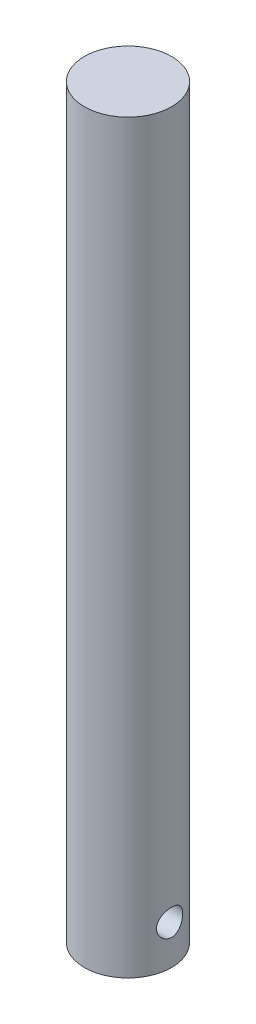
ISO-10303-21;
HEADER;
FILE_DESCRIPTION(('STEP AP214'),'2;1');
FILE_NAME('part.step','',(''),(''),'','','');
FILE_SCHEMA(('AUTOMOTIVE_DESIGN { 1 0 10303 214 1 1 1 1 }'));
ENDSEC;
DATA;
#1=APPLICATION_CONTEXT('core data for automotive mechanical design processes');
#2=APPLICATION_PROTOCOL_DEFINITION('international standard','automotive_design',2000,#1);
#3=PRODUCT_CONTEXT('',#1,'mechanical');
#4=PRODUCT('Part','Part','',(#3));
#5=PRODUCT_RELATED_PRODUCT_CATEGORY('part','',(#4));
#6=PRODUCT_DEFINITION_FORMATION('','',#4);
#7=PRODUCT_DEFINITION_CONTEXT('part definition',#1,'design');
#8=PRODUCT_DEFINITION('design','',#6,#7);
#9=PRODUCT_DEFINITION_SHAPE('','',#8);
#10=(LENGTH_UNIT() NAMED_UNIT(*) SI_UNIT(.MILLI.,.METRE.));
#11=(NAMED_UNIT(*) PLANE_ANGLE_UNIT() SI_UNIT($,.RADIAN.));
#12=(NAMED_UNIT(*) SI_UNIT($,.STERADIAN.) SOLID_ANGLE_UNIT());
#13=UNCERTAINTY_MEASURE_WITH_UNIT(LENGTH_MEASURE(1.E-05),#10,'distance_accuracy_value','');
#14=(GEOMETRIC_REPRESENTATION_CONTEXT(3) GLOBAL_UNCERTAINTY_ASSIGNED_CONTEXT((#13)) GLOBAL_UNIT_ASSIGNED_CONTEXT((#10,
#11,#12)) REPRESENTATION_CONTEXT('',''));
#15=CARTESIAN_POINT('',(0.,0.,0.));
#16=DIRECTION('',(0.,0.,1.));
#17=DIRECTION('',(1.,0.,0.));
#18=AXIS2_PLACEMENT_3D('',#15,#16,#17);
#19=CARTESIAN_POINT('',(0.,-21.,0.));
#20=DIRECTION('',(0.,1.,0.));
#21=DIRECTION('',(0.,0.,1.));
#22=AXIS2_PLACEMENT_3D('',#19,#20,#21);
#23=CYLINDRICAL_SURFACE('',#22,10.);
#24=CARTESIAN_POINT('',(-9.53939201416945,-12.,-3.));
#25=CARTESIAN_POINT('',(-9.53939371453959,-12.1643890958848,-2.99999795267528));
#26=CARTESIAN_POINT('',(-9.54368780418137,-12.3287984482881,-2.98644216334284));
#27=CARTESIAN_POINT('',(-9.56033156605799,-12.6528104991839,-2.93271688893498));
#28=CARTESIAN_POINT('',(-9.57268392986936,-12.8124115730029,-2.89253851147156));
#29=CARTESIAN_POINT('',(-9.60392204971265,-13.1220694565435,-2.78705506539911));
#30=CARTESIAN_POINT('',(-9.62279693406464,-13.2721416592662,-2.72179178788487));
#31=CARTESIAN_POINT('',(-9.66493865095134,-13.5592438679906,-2.56812843835858));
#32=CARTESIAN_POINT('',(-9.68820614082039,-13.6962719173689,-2.47972490274105));
#33=CARTESIAN_POINT('',(-9.73733724371531,-13.9577327811548,-2.27929508283254));
#34=CARTESIAN_POINT('',(-9.76325616623271,-14.0816917958926,-2.16666414351613));
#35=CARTESIAN_POINT('',(-9.81429723873514,-14.309275902645,-1.9222724751592));
#36=CARTESIAN_POINT('',(-9.8394192859541,-14.4128983808998,-1.79050929092222));
#37=CARTESIAN_POINT('',(-9.88666429158777,-14.5989253996666,-1.50822287558738));
#38=CARTESIAN_POINT('',(-9.90871448684808,-14.6808468488856,-1.35736804267163));
#39=CARTESIAN_POINT('',(-9.94668871841369,-14.8179745180855,-1.04324929073871));
#40=CARTESIAN_POINT('',(-9.96261407578992,-14.8731864997149,-0.879988056775822));
#41=CARTESIAN_POINT('',(-9.98615292007177,-14.953760002181,-0.550647705261659));
#42=CARTESIAN_POINT('',(-9.99399114738673,-14.9799302553054,-0.384782797907603));
#43=CARTESIAN_POINT('',(-10.001264030027,-15.0042346492929,-0.0508436474986282));
#44=CARTESIAN_POINT('',(-10.0007004504217,-15.0023746788039,0.117230124100743));
#45=CARTESIAN_POINT('',(-9.99139207635305,-14.971214262914,0.445142313200314));
#46=CARTESIAN_POINT('',(-9.98290840410475,-14.9427896123803,0.60507253528266));
#47=CARTESIAN_POINT('',(-9.95903044225231,-14.8607373280114,0.917778426885075));
#48=CARTESIAN_POINT('',(-9.9436357150134,-14.8071080981145,1.07055364264578));
#49=CARTESIAN_POINT('',(-9.90730441973756,-14.675575953163,1.36669465270248));
#50=CARTESIAN_POINT('',(-9.88630539352772,-14.5973975943861,1.50993012938864));
#51=CARTESIAN_POINT('',(-9.84099281296777,-14.419204295143,1.78152934756663));
#52=CARTESIAN_POINT('',(-9.81667847277943,-14.3191841740708,1.90988954974545));
#53=CARTESIAN_POINT('',(-9.76623100973852,-14.0956044984991,2.15332096305837));
#54=CARTESIAN_POINT('',(-9.74006390633503,-13.9712861619492,2.26768916079755));
#55=CARTESIAN_POINT('',(-9.68967959784414,-13.7049799642112,2.47415303080115));
#56=CARTESIAN_POINT('',(-9.66546258669242,-13.562990349189,2.56624648967452));
#57=CARTESIAN_POINT('',(-9.62155806359712,-13.2635210615278,2.72627990669511));
#58=CARTESIAN_POINT('',(-9.6019162125849,-13.1059059083825,2.79397978469378));
#59=CARTESIAN_POINT('',(-9.56992784963789,-12.7807855832214,2.90166725750739));
#60=CARTESIAN_POINT('',(-9.55757895796639,-12.6132836569649,2.94166389279494));
#61=CARTESIAN_POINT('',(-9.54209699116239,-12.2798352784976,2.99149540565762));
#62=CARTESIAN_POINT('',(-9.53863757349917,-12.1140635522056,3.00239892760807));
#63=CARTESIAN_POINT('',(-9.54042384874812,-11.7830541999867,2.99671894465741));
#64=CARTESIAN_POINT('',(-9.54566832310786,-11.61781650254,2.98013928742559));
#65=CARTESIAN_POINT('',(-9.56395117112153,-11.2970232440566,2.92091527148479));
#66=CARTESIAN_POINT('',(-9.57678353015602,-11.1413276714725,2.87895922862587));
#67=CARTESIAN_POINT('',(-9.6085828246183,-10.8391966183706,2.77097155495853));
#68=CARTESIAN_POINT('',(-9.62755070717977,-10.692762571719,2.70493620685512));
#69=CARTESIAN_POINT('',(-9.67011670046268,-10.4089650718556,2.54863742393008));
#70=CARTESIAN_POINT('',(-9.69382542139644,-10.2719505580284,2.4577712834546));
#71=CARTESIAN_POINT('',(-9.74296411293927,-10.0147237876384,2.25510603200767));
#72=CARTESIAN_POINT('',(-9.76839449459993,-9.89451556477443,2.14330191069792));
#73=CARTESIAN_POINT('',(-9.81927267096329,-9.66963918837052,1.8969102649872));
#74=CARTESIAN_POINT('',(-9.84468490126011,-9.56572874202603,1.76162213171487));
#75=CARTESIAN_POINT('',(-9.89169703497297,-9.3820665979445,1.4749235691805));
#76=CARTESIAN_POINT('',(-9.91329712769433,-9.30231370043708,1.32351394108789));
#77=CARTESIAN_POINT('',(-9.95011940949915,-9.16999993886341,1.00987100941044));
#78=CARTESIAN_POINT('',(-9.96538906849931,-9.11723596768205,0.847729244075677));
#79=CARTESIAN_POINT('',(-9.98803959193653,-9.03987816221916,0.516339933009176));
#80=CARTESIAN_POINT('',(-9.9954227134176,-9.01527626810317,0.347094434709525));
#81=CARTESIAN_POINT('',(-10.001330881628,-8.995553911891,0.0133043077654852));
#82=CARTESIAN_POINT('',(-10.0001861022264,-8.99933460918434,-0.151170358172414));
#83=CARTESIAN_POINT('',(-9.98994528930073,-9.03364326499824,-0.477038962328808));
#84=CARTESIAN_POINT('',(-9.98084970660925,-9.06416970696089,-0.638433074693057));
#85=CARTESIAN_POINT('',(-9.95582336716653,-9.15042332279925,-0.951871626082716));
#86=CARTESIAN_POINT('',(-9.93996705801731,-9.20587636129803,-1.10399785470278));
#87=CARTESIAN_POINT('',(-9.90305886078899,-9.34016382901438,-1.39686647550411));
#88=CARTESIAN_POINT('',(-9.88200611899892,-9.41900210057238,-1.53760699210116));
#89=CARTESIAN_POINT('',(-9.83607931656456,-9.60074691486007,-1.80860378484113));
#90=CARTESIAN_POINT('',(-9.81110453847118,-9.70434286000154,-1.93838050015353));
#91=CARTESIAN_POINT('',(-9.76047074424667,-9.9314207766656,-2.17907514269189));
#92=CARTESIAN_POINT('',(-9.73481153282158,-10.0549084757963,-2.28998761920387));
#93=CARTESIAN_POINT('',(-9.68481361262638,-10.322681556621,-2.49312538789097));
#94=CARTESIAN_POINT('',(-9.6605370538697,-10.4674771067809,-2.58469519515913));
#95=CARTESIAN_POINT('',(-9.61705095017586,-10.771110348322,-2.74208627057551));
#96=CARTESIAN_POINT('',(-9.59783897193911,-10.9299412472024,-2.80791991114577));
#97=CARTESIAN_POINT('',(-9.56855633435189,-11.2394808632126,-2.90603885065899));
#98=CARTESIAN_POINT('',(-9.5577230968104,-11.389217293862,-2.94117718022463));
#99=CARTESIAN_POINT('',(-9.54314085194333,-11.6926304449915,-2.98815637670288));
#100=CARTESIAN_POINT('',(-9.53939042442861,-11.8463063692905,-3.00000191412191));
#101=CARTESIAN_POINT('',(-9.53939201416945,-12.,-3.));
#102=B_SPLINE_CURVE_WITH_KNOTS('',3,(#24,#25,#26,#27,#28,#29,#30,#31,#32,#33,#34,#35,#36,#37,
#38,#39,#40,#41,#42,#43,#44,#45,#46,#47,#48,#49,#50,#51,#52,#53,#54,#55,#56,#57,#58,#59,#60,#61,
#62,#63,#64,#65,#66,#67,#68,#69,#70,#71,#72,#73,#74,#75,#76,#77,#78,#79,#80,#81,#82,#83,#84,#85,
#86,#87,#88,#89,#90,#91,#92,#93,#94,#95,#96,#97,#98,#99,#100,#101),.UNSPECIFIED.,.T.,.F.,(4,2,2,
2,2,2,2,2,2,2,2,2,2,2,2,2,2,2,2,2,2,2,2,2,2,2,2,2,2,2,2,2,2,2,2,2,2,2,4),(0.,0.492600331831084,
0.985365283377999,1.47731282893239,1.9693340507402,2.47546300015968,2.98165695742546,
3.49831878547289,4.01486911175754,4.51664280299115,5.01831108202881,5.5040025198176,
5.98972471780752,6.48110418671353,6.97260033181661,7.48304294046556,7.99353624983726,
8.50892476494934,9.02414501262033,9.52016161585829,10.0161087821999,10.4991718988284,
10.9823096209678,11.4784146362399,11.9746385186306,12.4895901220641,13.0045161465361,
13.5155078363386,14.0263532464857,14.5175260782765,15.0086710610072,15.4945419374965,
15.9804926898797,16.4819925411419,16.9836370526499,17.500232793435,18.016579879331,
18.4772230772011,18.9377739007233),.UNSPECIFIED.);
#103=CARTESIAN_POINT('',(-9.53939201416945,-12.,-3.));
#104=VERTEX_POINT('',#103);
#105=EDGE_CURVE('E41',#104,#104,#102,.T.);
#106=ORIENTED_EDGE('',*,*,#105,.F.);
#107=EDGE_LOOP('',(#106));
#108=FACE_BOUND('',#107,.T.);
#109=CARTESIAN_POINT('',(9.53939201416946,-12.,-3.));
#110=CARTESIAN_POINT('',(9.5393937145396,-11.8356109041152,-2.99999795267528));
#111=CARTESIAN_POINT('',(9.54368780418137,-11.671201551712,-2.98644216334284));
#112=CARTESIAN_POINT('',(9.56033156605799,-11.3471895008161,-2.93271688893498));
#113=CARTESIAN_POINT('',(9.57268392986935,-11.1875884269971,-2.89253851147156));
#114=CARTESIAN_POINT('',(9.60392204971265,-10.8779305434565,-2.78705506539911));
#115=CARTESIAN_POINT('',(9.62279693406464,-10.7278583407338,-2.72179178788487));
#116=CARTESIAN_POINT('',(9.66493865095134,-10.4407561320094,-2.56812843835858));
#117=CARTESIAN_POINT('',(9.68820614082039,-10.3037280826311,-2.47972490274105));
#118=CARTESIAN_POINT('',(9.73733724371531,-10.0422672188453,-2.27929508283254));
#119=CARTESIAN_POINT('',(9.76325616623271,-9.91830820410743,-2.16666414351613));
#120=CARTESIAN_POINT('',(9.81429723873514,-9.69072409735498,-1.9222724751592));
#121=CARTESIAN_POINT('',(9.8394192859541,-9.58710161910024,-1.79050929092222));
#122=CARTESIAN_POINT('',(9.88666429158777,-9.40107460033339,-1.50822287558738));
#123=CARTESIAN_POINT('',(9.90871448684808,-9.31915315111438,-1.35736804267163));
#124=CARTESIAN_POINT('',(9.94668871841369,-9.18202548191449,-1.04324929073871));
#125=CARTESIAN_POINT('',(9.96261407578992,-9.1268135002851,-0.879988056775822));
#126=CARTESIAN_POINT('',(9.98615292007177,-9.04623999781898,-0.550647705261658));
#127=CARTESIAN_POINT('',(9.99399114738673,-9.0200697446946,-0.384782797907602));
#128=CARTESIAN_POINT('',(10.001264030027,-8.99576535070712,-0.0508436474986273));
#129=CARTESIAN_POINT('',(10.0007004504217,-8.99762532119609,0.117230124100744));
#130=CARTESIAN_POINT('',(9.99139207635305,-9.02878573708604,0.445142313200315));
#131=CARTESIAN_POINT('',(9.98290840410475,-9.0572103876197,0.605072535282661));
#132=CARTESIAN_POINT('',(9.95903044225231,-9.13926267198862,0.917778426885076));
#133=CARTESIAN_POINT('',(9.9436357150134,-9.1928919018855,1.07055364264578));
#134=CARTESIAN_POINT('',(9.90730441973756,-9.32442404683696,1.36669465270248));
#135=CARTESIAN_POINT('',(9.88630539352772,-9.40260240561395,1.50993012938864));
#136=CARTESIAN_POINT('',(9.84099281296777,-9.58079570485705,1.78152934756663));
#137=CARTESIAN_POINT('',(9.81667847277943,-9.68081582592917,1.90988954974545));
#138=CARTESIAN_POINT('',(9.76623100973852,-9.90439550150091,2.15332096305837));
#139=CARTESIAN_POINT('',(9.74006390633502,-10.0287138380508,2.26768916079755));
#140=CARTESIAN_POINT('',(9.68967959784414,-10.2950200357888,2.47415303080115));
#141=CARTESIAN_POINT('',(9.66546258669242,-10.437009650811,2.56624648967452));
#142=CARTESIAN_POINT('',(9.62155806359712,-10.7364789384722,2.72627990669512));
#143=CARTESIAN_POINT('',(9.6019162125849,-10.8940940916175,2.79397978469378));
#144=CARTESIAN_POINT('',(9.5699278496379,-11.2192144167786,2.90166725750739));
#145=CARTESIAN_POINT('',(9.55757895796639,-11.3867163430351,2.94166389279494));
#146=CARTESIAN_POINT('',(9.54209699116239,-11.7201647215024,2.99149540565762));
#147=CARTESIAN_POINT('',(9.53863757349917,-11.8859364477944,3.00239892760807));
#148=CARTESIAN_POINT('',(9.54042384874812,-12.2169458000133,2.99671894465741));
#149=CARTESIAN_POINT('',(9.54566832310786,-12.38218349746,2.98013928742559));
#150=CARTESIAN_POINT('',(9.56395117112153,-12.7029767559434,2.92091527148479));
#151=CARTESIAN_POINT('',(9.57678353015602,-12.8586723285275,2.87895922862587));
#152=CARTESIAN_POINT('',(9.6085828246183,-13.1608033816294,2.77097155495853));
#153=CARTESIAN_POINT('',(9.62755070717977,-13.307237428281,2.70493620685512));
#154=CARTESIAN_POINT('',(9.67011670046268,-13.5910349281444,2.54863742393008));
#155=CARTESIAN_POINT('',(9.69382542139644,-13.7280494419716,2.4577712834546));
#156=CARTESIAN_POINT('',(9.74296411293927,-13.9852762123616,2.25510603200767));
#157=CARTESIAN_POINT('',(9.76839449459993,-14.1054844352256,2.14330191069792));
#158=CARTESIAN_POINT('',(9.81927267096329,-14.3303608116295,1.8969102649872));
#159=CARTESIAN_POINT('',(9.84468490126011,-14.434271257974,1.76162213171487));
#160=CARTESIAN_POINT('',(9.89169703497297,-14.6179334020555,1.47492356918049));
#161=CARTESIAN_POINT('',(9.91329712769433,-14.6976862995629,1.32351394108789));
#162=CARTESIAN_POINT('',(9.95011940949915,-14.8300000611366,1.00987100941044));
#163=CARTESIAN_POINT('',(9.96538906849931,-14.882764032318,0.847729244075675));
#164=CARTESIAN_POINT('',(9.98803959193653,-14.9601218377808,0.516339933009173));
#165=CARTESIAN_POINT('',(9.9954227134176,-14.9847237318968,0.347094434709523));
#166=CARTESIAN_POINT('',(10.001330881628,-15.004446088109,0.0133043077654841));
#167=CARTESIAN_POINT('',(10.0001861022264,-15.0006653908157,-0.151170358172415));
#168=CARTESIAN_POINT('',(9.98994528930073,-14.9663567350018,-0.477038962328809));
#169=CARTESIAN_POINT('',(9.98084970660925,-14.9358302930391,-0.638433074693059));
#170=CARTESIAN_POINT('',(9.95582336716653,-14.8495766772008,-0.951871626082718));
#171=CARTESIAN_POINT('',(9.93996705801731,-14.794123638702,-1.10399785470279));
#172=CARTESIAN_POINT('',(9.90305886078899,-14.6598361709856,-1.39686647550411));
#173=CARTESIAN_POINT('',(9.88200611899892,-14.5809978994276,-1.53760699210116));
#174=CARTESIAN_POINT('',(9.83607931656456,-14.3992530851399,-1.80860378484113));
#175=CARTESIAN_POINT('',(9.81110453847118,-14.2956571399985,-1.93838050015354));
#176=CARTESIAN_POINT('',(9.76047074424667,-14.0685792233344,-2.17907514269189));
#177=CARTESIAN_POINT('',(9.73481153282158,-13.9450915242037,-2.28998761920387));
#178=CARTESIAN_POINT('',(9.68481361262638,-13.677318443379,-2.49312538789097));
#179=CARTESIAN_POINT('',(9.6605370538697,-13.5325228932191,-2.58469519515913));
#180=CARTESIAN_POINT('',(9.61705095017586,-13.228889651678,-2.74208627057551));
#181=CARTESIAN_POINT('',(9.59783897193911,-13.0700587527976,-2.80791991114577));
#182=CARTESIAN_POINT('',(9.56855633435189,-12.7605191367875,-2.90603885065899));
#183=CARTESIAN_POINT('',(9.5577230968104,-12.610782706138,-2.94117718022463));
#184=CARTESIAN_POINT('',(9.54314085194333,-12.3073695550085,-2.98815637670288));
#185=CARTESIAN_POINT('',(9.53939042442861,-12.1536936307095,-3.00000191412191));
#186=CARTESIAN_POINT('',(9.53939201416946,-12.,-3.));
#187=B_SPLINE_CURVE_WITH_KNOTS('',3,(#109,#110,#111,#112,#113,#114,#115,#116,#117,#118,#119,
#120,#121,#122,#123,#124,#125,#126,#127,#128,#129,#130,#131,#132,#133,#134,#135,#136,#137,#138,
#139,#140,#141,#142,#143,#144,#145,#146,#147,#148,#149,#150,#151,#152,#153,#154,#155,#156,#157,
#158,#159,#160,#161,#162,#163,#164,#165,#166,#167,#168,#169,#170,#171,#172,#173,#174,#175,#176,
#177,#178,#179,#180,#181,#182,#183,#184,#185,#186),.UNSPECIFIED.,.T.,.F.,(4,2,2,2,2,2,2,2,2,2,2,
2,2,2,2,2,2,2,2,2,2,2,2,2,2,2,2,2,2,2,2,2,2,2,2,2,2,2,4),(0.,0.492600331831085,
0.985365283377999,1.47731282893239,1.9693340507402,2.47546300015968,2.98165695742546,
3.49831878547289,4.01486911175754,4.51664280299115,5.01831108202881,5.5040025198176,
5.98972471780752,6.48110418671353,6.97260033181661,7.48304294046556,7.99353624983726,
8.50892476494934,9.02414501262032,9.52016161585829,10.0161087821998,10.4991718988284,
10.9823096209678,11.4784146362399,11.9746385186306,12.4895901220641,13.0045161465361,
13.5155078363386,14.0263532464857,14.5175260782765,15.0086710610072,15.4945419374965,
15.9804926898797,16.4819925411419,16.9836370526499,17.500232793435,18.016579879331,
18.477223077201,18.9377739007233),.UNSPECIFIED.);
#188=CARTESIAN_POINT('',(9.53939201416946,-12.,-3.));
#189=VERTEX_POINT('',#188);
#190=EDGE_CURVE('E57',#189,#189,#187,.T.);
#191=ORIENTED_EDGE('',*,*,#190,.F.);
#192=EDGE_LOOP('',(#191));
#193=FACE_BOUND('',#192,.T.);
#194=CARTESIAN_POINT('',(0.,-21.,0.));
#195=DIRECTION('',(0.,1.,0.));
#196=DIRECTION('',(0.,0.,1.));
#197=AXIS2_PLACEMENT_3D('',#194,#195,#196);
#198=CIRCLE('',#197,10.);
#199=CARTESIAN_POINT('',(0.,-21.,10.));
#200=VERTEX_POINT('',#199);
#201=EDGE_CURVE('E10',#200,#200,#198,.T.);
#202=ORIENTED_EDGE('',*,*,#201,.T.);
#203=EDGE_LOOP('',(#202));
#204=FACE_BOUND('',#203,.T.);
#205=CARTESIAN_POINT('',(0.,150.,0.));
#206=DIRECTION('',(0.,1.,0.));
#207=DIRECTION('',(0.,0.,1.));
#208=AXIS2_PLACEMENT_3D('',#205,#206,#207);
#209=CIRCLE('',#208,10.);
#210=CARTESIAN_POINT('',(0.,150.,10.));
#211=VERTEX_POINT('',#210);
#212=EDGE_CURVE('E50',#211,#211,#209,.T.);
#213=ORIENTED_EDGE('',*,*,#212,.F.);
#214=EDGE_LOOP('',(#213));
#215=FACE_BOUND('',#214,.T.);
#216=ADVANCED_FACE('F37',(#108,#193,#204,#215),#23,.T.);
#217=CARTESIAN_POINT('',(0.,-21.,0.));
#218=DIRECTION('',(0.,1.,0.));
#219=DIRECTION('',(0.,0.,1.));
#220=AXIS2_PLACEMENT_3D('',#217,#218,#219);
#221=PLANE('',#220);
#222=ORIENTED_EDGE('',*,*,#201,.F.);
#223=EDGE_LOOP('',(#222));
#224=FACE_BOUND('',#223,.T.);
#225=ADVANCED_FACE('F71',(#224),#221,.F.);
#226=CARTESIAN_POINT('',(0.,150.,0.));
#227=DIRECTION('',(0.,1.,0.));
#228=DIRECTION('',(0.,0.,1.));
#229=AXIS2_PLACEMENT_3D('',#226,#227,#228);
#230=PLANE('',#229);
#231=ORIENTED_EDGE('',*,*,#212,.T.);
#232=EDGE_LOOP('',(#231));
#233=FACE_BOUND('',#232,.T.);
#234=ADVANCED_FACE('F67',(#233),#230,.T.);
#235=CARTESIAN_POINT('',(-12.5,-12.,0.));
#236=DIRECTION('',(1.,0.,0.));
#237=DIRECTION('',(0.,0.,-1.));
#238=AXIS2_PLACEMENT_3D('',#235,#236,#237);
#239=CYLINDRICAL_SURFACE('',#238,3.);
#240=ORIENTED_EDGE('',*,*,#105,.T.);
#241=EDGE_LOOP('',(#240));
#242=FACE_BOUND('',#241,.T.);
#243=ORIENTED_EDGE('',*,*,#190,.T.);
#244=EDGE_LOOP('',(#243));
#245=FACE_BOUND('',#244,.T.);
#246=ADVANCED_FACE('F63',(#242,#245),#239,.F.);
#247=CLOSED_SHELL('',(#216,#225,#234,#246));
#248=MANIFOLD_SOLID_BREP('B2',#247);
#249=ADVANCED_BREP_SHAPE_REPRESENTATION('',(#18,#248),#14);
#250=SHAPE_DEFINITION_REPRESENTATION(#9,#249);
ENDSEC;
END-ISO-10303-21;
